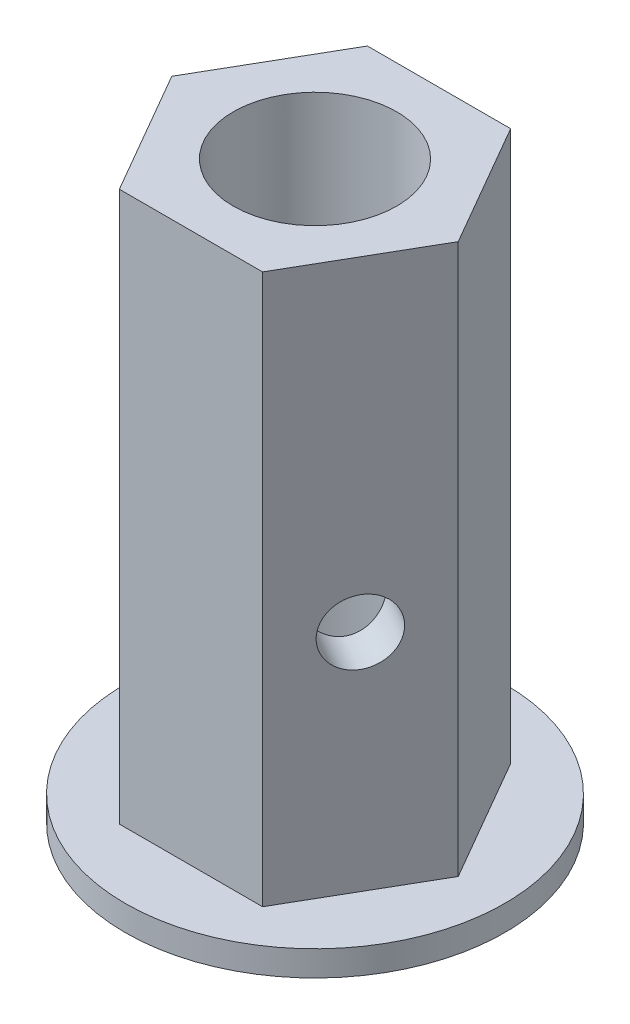
ISO-10303-21;
HEADER;
FILE_DESCRIPTION(('STEP AP214'),'2;1');
FILE_NAME('part.step','',(''),(''),'','','');
FILE_SCHEMA(('AUTOMOTIVE_DESIGN { 1 0 10303 214 1 1 1 1 }'));
ENDSEC;
DATA;
#1=APPLICATION_CONTEXT('core data for automotive mechanical design processes');
#2=APPLICATION_PROTOCOL_DEFINITION('international standard','automotive_design',2000,#1);
#3=PRODUCT_CONTEXT('',#1,'mechanical');
#4=PRODUCT('Part','Part','',(#3));
#5=PRODUCT_RELATED_PRODUCT_CATEGORY('part','',(#4));
#6=PRODUCT_DEFINITION_FORMATION('','',#4);
#7=PRODUCT_DEFINITION_CONTEXT('part definition',#1,'design');
#8=PRODUCT_DEFINITION('design','',#6,#7);
#9=PRODUCT_DEFINITION_SHAPE('','',#8);
#10=(LENGTH_UNIT() NAMED_UNIT(*) SI_UNIT(.MILLI.,.METRE.));
#11=(NAMED_UNIT(*) PLANE_ANGLE_UNIT() SI_UNIT($,.RADIAN.));
#12=(NAMED_UNIT(*) SI_UNIT($,.STERADIAN.) SOLID_ANGLE_UNIT());
#13=UNCERTAINTY_MEASURE_WITH_UNIT(LENGTH_MEASURE(1.E-05),#10,'distance_accuracy_value','');
#14=(GEOMETRIC_REPRESENTATION_CONTEXT(3) GLOBAL_UNCERTAINTY_ASSIGNED_CONTEXT((#13)) GLOBAL_UNIT_ASSIGNED_CONTEXT((#10,
#11,#12)) REPRESENTATION_CONTEXT('',''));
#15=CARTESIAN_POINT('',(0.,0.,0.));
#16=DIRECTION('',(0.,0.,1.));
#17=DIRECTION('',(1.,0.,0.));
#18=AXIS2_PLACEMENT_3D('',#15,#16,#17);
#19=CARTESIAN_POINT('',(-8.08391413162584,11.2776,-4.66725));
#20=DIRECTION('',(0.866025403784439,0.,0.5));
#21=DIRECTION('',(0.5,0.,-0.866025403784439));
#22=AXIS2_PLACEMENT_3D('',#19,#20,#21);
#23=CYLINDRICAL_SURFACE('',#22,1.6256);
#24=CARTESIAN_POINT('',(-2.44886932528421,11.2776,-3.29093655935237));
#25=CARTESIAN_POINT('',(-2.44888147324609,11.3647573048652,-3.29093271541478));
#26=CARTESIAN_POINT('',(-2.45505195509965,11.4520420576293,-3.28636415152895));
#27=CARTESIAN_POINT('',(-2.47927375272547,11.6241122051898,-3.26812494900121));
#28=CARTESIAN_POINT('',(-2.4973557667036,11.7088905490451,-3.25443079096739));
#29=CARTESIAN_POINT('',(-2.54392980849633,11.8731688700039,-3.21815273112463));
#30=CARTESIAN_POINT('',(-2.57238305406662,11.9526872242342,-3.19560192389171));
#31=CARTESIAN_POINT('',(-2.63782564146271,12.1049127393341,-3.14179683265406));
#32=CARTESIAN_POINT('',(-2.67481300206483,12.1776214755799,-3.11054456837446));
#33=CARTESIAN_POINT('',(-2.75733722691533,12.3182868121163,-3.03767861832686));
#34=CARTESIAN_POINT('',(-2.803213336595,12.3858134007232,-2.99561865056898));
#35=CARTESIAN_POINT('',(-2.89975632976159,12.5102660322667,-2.90226525996849));
#36=CARTESIAN_POINT('',(-2.95042486228355,12.5671884062225,-2.85096865334377));
#37=CARTESIAN_POINT('',(-3.05617045614329,12.6709380062377,-2.737386936309));
#38=CARTESIAN_POINT('',(-3.11134218568017,12.7172909491985,-2.67475419738384));
#39=CARTESIAN_POINT('',(-3.22158988359742,12.7953909960857,-2.54088277809653));
#40=CARTESIAN_POINT('',(-3.27666588147116,12.8271439395578,-2.4696475528811));
#41=CARTESIAN_POINT('',(-3.38159037782985,12.8736133561574,-2.32373752325829));
#42=CARTESIAN_POINT('',(-3.43156291603913,12.8890690351168,-2.24938800113922));
#43=CARTESIAN_POINT('',(-3.5271066331944,12.9048836773106,-2.09639337310828));
#44=CARTESIAN_POINT('',(-3.57267941613632,12.9052481631556,-2.01774984913289));
#45=CARTESIAN_POINT('',(-3.65559443332161,12.8912791964736,-1.8630977608545));
#46=CARTESIAN_POINT('',(-3.69325196844795,12.8777552118649,-1.78718306847896));
#47=CARTESIAN_POINT('',(-3.76263531184747,12.8377677257538,-1.63606721520194));
#48=CARTESIAN_POINT('',(-3.79436068530561,12.811303276256,-1.56086610698786));
#49=CARTESIAN_POINT('',(-3.85214936826359,12.7458595340862,-1.4123111892452));
#50=CARTESIAN_POINT('',(-3.87812053084457,12.706698335491,-1.33900205769166));
#51=CARTESIAN_POINT('',(-3.92410683161276,12.6171416512963,-1.19755975518268));
#52=CARTESIAN_POINT('',(-3.94411993941416,12.5667423461848,-1.1294283545713));
#53=CARTESIAN_POINT('',(-3.97994560252874,12.4523447447533,-0.996154348355632));
#54=CARTESIAN_POINT('',(-3.99540339573172,12.3876783944133,-0.931488948450088));
#55=CARTESIAN_POINT('',(-4.02128276858034,12.2484957204585,-0.812541036929739));
#56=CARTESIAN_POINT('',(-4.03170276234967,12.1739763045325,-0.758261798075933));
#57=CARTESIAN_POINT('',(-4.04880004572146,12.0146096699937,-0.661024716287477));
#58=CARTESIAN_POINT('',(-4.05536747179366,11.929536154508,-0.618416142119181));
#59=CARTESIAN_POINT('',(-4.06536912867255,11.7530461818509,-0.548860482295999));
#60=CARTESIAN_POINT('',(-4.06880535052941,11.6616337952553,-0.521903448202387));
#61=CARTESIAN_POINT('',(-4.07318756676947,11.4809455704553,-0.486486296882775));
#62=CARTESIAN_POINT('',(-4.07427107701614,11.3918726384786,-0.477009938699841));
#63=CARTESIAN_POINT('',(-4.07461876148592,11.2134698548878,-0.474037924438001));
#64=CARTESIAN_POINT('',(-4.07388347163581,11.1241400867004,-0.48053756087635));
#65=CARTESIAN_POINT('',(-4.07051016159081,10.9529658584926,-0.508275845096493));
#66=CARTESIAN_POINT('',(-4.06797993464985,10.8709810324101,-0.528677027222282));
#67=CARTESIAN_POINT('',(-4.06065976630209,10.7114035141565,-0.582229925679649));
#68=CARTESIAN_POINT('',(-4.05586932959691,10.633811788858,-0.615384436458852));
#69=CARTESIAN_POINT('',(-4.04308872398429,10.4817527372895,-0.69449266713499));
#70=CARTESIAN_POINT('',(-4.03497788410727,10.4075356827968,-0.740906555824861));
#71=CARTESIAN_POINT('',(-4.01467302317274,10.2672473147095,-0.844028114131318));
#72=CARTESIAN_POINT('',(-4.00247736223928,10.2011792871891,-0.900739913712852));
#73=CARTESIAN_POINT('',(-3.97203927195586,10.0741045550755,-1.02695339014244));
#74=CARTESIAN_POINT('',(-3.95342364558654,10.0138083424956,-1.09708307515602));
#75=CARTESIAN_POINT('',(-3.90950730998196,9.90571900426035,-1.24454337401823));
#76=CARTESIAN_POINT('',(-3.88420637115225,9.85792630812697,-1.32187423511858));
#77=CARTESIAN_POINT('',(-3.82633855894687,9.77640113946094,-1.48105183233594));
#78=CARTESIAN_POINT('',(-3.79377743868316,9.74265759447489,-1.56289495440586));
#79=CARTESIAN_POINT('',(-3.7213691836431,9.69052976723193,-1.72822474967795));
#80=CARTESIAN_POINT('',(-3.68152593528032,9.67213732122421,-1.81171052510191));
#81=CARTESIAN_POINT('',(-3.59808337904013,9.65219022594811,-1.97196768320743));
#82=CARTESIAN_POINT('',(-3.5548894747199,9.64963032372997,-2.04882601127039));
#83=CARTESIAN_POINT('',(-3.46403130868576,9.65877681768701,-2.19895560711226));
#84=CARTESIAN_POINT('',(-3.41636770309134,9.67048112299726,-2.27222739897261));
#85=CARTESIAN_POINT('',(-3.3197574159196,9.70710678130947,-2.41109640916123));
#86=CARTESIAN_POINT('',(-3.27089095953944,9.7316250127182,-2.47685698992836));
#87=CARTESIAN_POINT('',(-3.1723840673455,9.7927625206242,-2.60183423625484));
#88=CARTESIAN_POINT('',(-3.12274348915566,9.82938404877108,-2.66104968144559));
#89=CARTESIAN_POINT('',(-3.02244040465712,9.91550356341173,-2.77453891989434));
#90=CARTESIAN_POINT('',(-2.97182877657834,9.9654964605025,-2.82848143203808));
#91=CARTESIAN_POINT('',(-2.8740189938306,10.07619374555,-2.9278161186575));
#92=CARTESIAN_POINT('',(-2.82682222531534,10.1369024492362,-2.97320483285392));
#93=CARTESIAN_POINT('',(-2.73536034104265,10.2716514019271,-3.05763560970597));
#94=CARTESIAN_POINT('',(-2.69144546542943,10.3462760856868,-3.0961273971702));
#95=CARTESIAN_POINT('',(-2.61257562826085,10.5043486023814,-3.16296661751035));
#96=CARTESIAN_POINT('',(-2.57762178885791,10.5877975384935,-3.19131278006875));
#97=CARTESIAN_POINT('',(-2.52179303110655,10.7536198482867,-3.23557422778027));
#98=CARTESIAN_POINT('',(-2.49994398460341,10.8354314920089,-3.25236942661404));
#99=CARTESIAN_POINT('',(-2.4673789019941,11.0023861447986,-3.27714823440361));
#100=CARTESIAN_POINT('',(-2.45663165848253,11.0875191136162,-3.28515654745059));
#101=CARTESIAN_POINT('',(-2.44984618594192,11.207850297591,-3.29020835341419));
#102=CARTESIAN_POINT('',(-2.44886446301387,11.2427149400107,-3.29093809790378));
#103=CARTESIAN_POINT('',(-2.44886932528421,11.2776,-3.29093655935237));
#104=B_SPLINE_CURVE_WITH_KNOTS('',3,(#24,#25,#26,#27,#28,#29,#30,#31,#32,#33,#34,#35,#36,#37,
#38,#39,#40,#41,#42,#43,#44,#45,#46,#47,#48,#49,#50,#51,#52,#53,#54,#55,#56,#57,#58,#59,#60,#61,
#62,#63,#64,#65,#66,#67,#68,#69,#70,#71,#72,#73,#74,#75,#76,#77,#78,#79,#80,#81,#82,#83,#84,#85,
#86,#87,#88,#89,#90,#91,#92,#93,#94,#95,#96,#97,#98,#99,#100,#101,#102,#103),.UNSPECIFIED.,.T.,
.F.,(4,2,2,2,2,2,2,2,2,2,2,2,2,2,2,2,2,2,2,2,2,2,2,2,2,2,2,2,2,2,2,2,2,2,2,2,2,2,2,4),(0.,
0.261365013998918,0.523406262777047,0.784477520279435,1.04548823007986,1.31977908942136,
1.59416467584825,1.87913772671217,2.16399669785731,2.43529202379324,2.70648806853342,
2.96272792506798,3.21898655609182,3.47909207892356,3.739286139315,4.01628446144667,
4.29336992470477,4.57801479471436,4.86247853999813,5.12980973496651,5.39706216763264,
5.64949194319093,5.90197706147529,6.1645926422707,6.42731377828807,6.70901529698276,
6.9907264914424,7.27221524073855,7.55355419809704,7.81682976710346,8.08006674949742,
8.33548084387315,8.59094248125203,8.85762447622715,9.12441412193311,9.40734834344265,
9.69031797831293,9.94817621365627,10.205307615064,10.3099200076403),.UNSPECIFIED.);
#105=CARTESIAN_POINT('',(-2.44886932528421,11.2776,-3.29093655935237));
#106=VERTEX_POINT('',#105);
#107=EDGE_CURVE('E154',#106,#106,#104,.T.);
#108=ORIENTED_EDGE('',*,*,#107,.T.);
#109=EDGE_LOOP('',(#108));
#110=FACE_BOUND('',#109,.T.);
#111=CARTESIAN_POINT('',(-5.38927608775056,11.2776,-3.1115));
#112=DIRECTION('',(0.866025403784439,0.,0.5));
#113=DIRECTION('',(0.5,0.,-0.866025403784439));
#114=AXIS2_PLACEMENT_3D('',#111,#112,#113);
#115=CIRCLE('',#114,1.6256);
#116=CARTESIAN_POINT('',(-4.57647608775056,11.2776,-4.51931089639199));
#117=VERTEX_POINT('',#116);
#118=EDGE_CURVE('E130',#117,#117,#115,.T.);
#119=ORIENTED_EDGE('',*,*,#118,.F.);
#120=EDGE_LOOP('',(#119));
#121=FACE_BOUND('',#120,.T.);
#122=ADVANCED_FACE('F34',(#110,#121),#23,.F.);
#123=CARTESIAN_POINT('',(3.59285072516704,27.5844,-6.223));
#124=DIRECTION('',(0.,0.,1.));
#125=DIRECTION('',(1.,0.,0.));
#126=AXIS2_PLACEMENT_3D('',#123,#124,#125);
#127=PLANE('',#126);
#128=DIRECTION('',(-1.,0.,0.));
#129=VECTOR('',#128,1.);
#130=CARTESIAN_POINT('',(3.59285072516704,0.,-6.223));
#131=LINE('',#130,#129);
#132=CARTESIAN_POINT('',(3.59285072516704,0.,-6.223));
#133=VERTEX_POINT('',#132);
#134=CARTESIAN_POINT('',(-3.59285072516704,0.,-6.223));
#135=VERTEX_POINT('',#134);
#136=EDGE_CURVE('E89',#133,#135,#131,.T.);
#137=ORIENTED_EDGE('',*,*,#136,.T.);
#138=DIRECTION('',(0.,-1.,0.));
#139=VECTOR('',#138,1.);
#140=CARTESIAN_POINT('',(-3.59285072516704,27.5844,-6.223));
#141=LINE('',#140,#139);
#142=CARTESIAN_POINT('',(-3.59285072516704,27.5844,-6.223));
#143=VERTEX_POINT('',#142);
#144=EDGE_CURVE('E11',#143,#135,#141,.T.);
#145=ORIENTED_EDGE('',*,*,#144,.F.);
#146=DIRECTION('',(-1.,0.,0.));
#147=VECTOR('',#146,1.);
#148=CARTESIAN_POINT('',(3.59285072516704,27.5844,-6.223));
#149=LINE('',#148,#147);
#150=CARTESIAN_POINT('',(3.59285072516704,27.5844,-6.223));
#151=VERTEX_POINT('',#150);
#152=EDGE_CURVE('E93',#151,#143,#149,.T.);
#153=ORIENTED_EDGE('',*,*,#152,.F.);
#154=DIRECTION('',(0.,-1.,0.));
#155=VECTOR('',#154,1.);
#156=CARTESIAN_POINT('',(3.59285072516704,27.5844,-6.223));
#157=LINE('',#156,#155);
#158=EDGE_CURVE('E106',#151,#133,#157,.T.);
#159=ORIENTED_EDGE('',*,*,#158,.T.);
#160=EDGE_LOOP('',(#137,#145,#153,#159));
#161=FACE_BOUND('',#160,.T.);
#162=ADVANCED_FACE('F36',(#161),#127,.F.);
#163=CARTESIAN_POINT('',(-3.59285072516704,27.5844,-6.223));
#164=DIRECTION('',(0.866025403784439,0.,0.5));
#165=DIRECTION('',(0.5,0.,-0.866025403784439));
#166=AXIS2_PLACEMENT_3D('',#163,#164,#165);
#167=PLANE('',#166);
#168=ORIENTED_EDGE('',*,*,#118,.T.);
#169=EDGE_LOOP('',(#168));
#170=FACE_BOUND('',#169,.T.);
#171=DIRECTION('',(-0.5,0.,0.866025403784439));
#172=VECTOR('',#171,1.);
#173=CARTESIAN_POINT('',(-3.59285072516704,0.,-6.223));
#174=LINE('',#173,#172);
#175=CARTESIAN_POINT('',(-7.18570145033408,0.,0.));
#176=VERTEX_POINT('',#175);
#177=EDGE_CURVE('E126',#135,#176,#174,.T.);
#178=ORIENTED_EDGE('',*,*,#177,.T.);
#179=DIRECTION('',(0.,-1.,0.));
#180=VECTOR('',#179,1.);
#181=CARTESIAN_POINT('',(-7.18570145033408,27.5844,0.));
#182=LINE('',#181,#180);
#183=CARTESIAN_POINT('',(-7.18570145033408,27.5844,0.));
#184=VERTEX_POINT('',#183);
#185=EDGE_CURVE('E43',#184,#176,#182,.T.);
#186=ORIENTED_EDGE('',*,*,#185,.F.);
#187=DIRECTION('',(-0.5,0.,0.866025403784439));
#188=VECTOR('',#187,1.);
#189=CARTESIAN_POINT('',(-3.59285072516704,27.5844,-6.223));
#190=LINE('',#189,#188);
#191=EDGE_CURVE('E125',#143,#184,#190,.T.);
#192=ORIENTED_EDGE('',*,*,#191,.F.);
#193=ORIENTED_EDGE('',*,*,#144,.T.);
#194=EDGE_LOOP('',(#178,#186,#192,#193));
#195=FACE_BOUND('',#194,.T.);
#196=ADVANCED_FACE('F124',(#170,#195),#167,.F.);
#197=CARTESIAN_POINT('',(-7.18570145033408,27.5844,0.));
#198=DIRECTION('',(0.866025403784439,0.,-0.5));
#199=DIRECTION('',(-0.5,0.,-0.866025403784439));
#200=AXIS2_PLACEMENT_3D('',#197,#198,#199);
#201=PLANE('',#200);
#202=DIRECTION('',(0.5,0.,0.866025403784439));
#203=VECTOR('',#202,1.);
#204=CARTESIAN_POINT('',(-7.18570145033408,0.,0.));
#205=LINE('',#204,#203);
#206=CARTESIAN_POINT('',(-3.59285072516704,0.,6.223));
#207=VERTEX_POINT('',#206);
#208=EDGE_CURVE('E120',#176,#207,#205,.T.);
#209=ORIENTED_EDGE('',*,*,#208,.T.);
#210=DIRECTION('',(0.,-1.,0.));
#211=VECTOR('',#210,1.);
#212=CARTESIAN_POINT('',(-3.59285072516704,27.5844,6.223));
#213=LINE('',#212,#211);
#214=CARTESIAN_POINT('',(-3.59285072516704,27.5844,6.223));
#215=VERTEX_POINT('',#214);
#216=EDGE_CURVE('E108',#215,#207,#213,.T.);
#217=ORIENTED_EDGE('',*,*,#216,.F.);
#218=DIRECTION('',(0.5,0.,0.866025403784439));
#219=VECTOR('',#218,1.);
#220=CARTESIAN_POINT('',(-7.18570145033408,27.5844,0.));
#221=LINE('',#220,#219);
#222=EDGE_CURVE('E121',#184,#215,#221,.T.);
#223=ORIENTED_EDGE('',*,*,#222,.F.);
#224=ORIENTED_EDGE('',*,*,#185,.T.);
#225=EDGE_LOOP('',(#209,#217,#223,#224));
#226=FACE_BOUND('',#225,.T.);
#227=ADVANCED_FACE('F118',(#226),#201,.F.);
#228=CARTESIAN_POINT('',(-3.59285072516704,27.5844,6.223));
#229=DIRECTION('',(0.,0.,-1.));
#230=DIRECTION('',(-1.,0.,0.));
#231=AXIS2_PLACEMENT_3D('',#228,#229,#230);
#232=PLANE('',#231);
#233=DIRECTION('',(1.,0.,0.));
#234=VECTOR('',#233,1.);
#235=CARTESIAN_POINT('',(-3.59285072516704,0.,6.223));
#236=LINE('',#235,#234);
#237=CARTESIAN_POINT('',(3.59285072516704,0.,6.223));
#238=VERTEX_POINT('',#237);
#239=EDGE_CURVE('E103',#207,#238,#236,.T.);
#240=ORIENTED_EDGE('',*,*,#239,.T.);
#241=DIRECTION('',(0.,-1.,0.));
#242=VECTOR('',#241,1.);
#243=CARTESIAN_POINT('',(3.59285072516704,27.5844,6.223));
#244=LINE('',#243,#242);
#245=CARTESIAN_POINT('',(3.59285072516704,27.5844,6.223));
#246=VERTEX_POINT('',#245);
#247=EDGE_CURVE('E102',#246,#238,#244,.T.);
#248=ORIENTED_EDGE('',*,*,#247,.F.);
#249=DIRECTION('',(1.,0.,0.));
#250=VECTOR('',#249,1.);
#251=CARTESIAN_POINT('',(-3.59285072516704,27.5844,6.223));
#252=LINE('',#251,#250);
#253=EDGE_CURVE('E137',#215,#246,#252,.T.);
#254=ORIENTED_EDGE('',*,*,#253,.F.);
#255=ORIENTED_EDGE('',*,*,#216,.T.);
#256=EDGE_LOOP('',(#240,#248,#254,#255));
#257=FACE_BOUND('',#256,.T.);
#258=ADVANCED_FACE('F135',(#257),#232,.F.);
#259=CARTESIAN_POINT('',(3.59285072516704,27.5844,6.223));
#260=DIRECTION('',(-0.866025403784439,0.,-0.5));
#261=DIRECTION('',(-0.5,0.,0.866025403784439));
#262=AXIS2_PLACEMENT_3D('',#259,#260,#261);
#263=PLANE('',#262);
#264=CARTESIAN_POINT('',(5.38927608775056,11.2776,3.1115));
#265=DIRECTION('',(0.866025403784439,0.,0.5));
#266=DIRECTION('',(0.5,0.,-0.866025403784439));
#267=AXIS2_PLACEMENT_3D('',#264,#265,#266);
#268=CIRCLE('',#267,1.6256);
#269=CARTESIAN_POINT('',(6.20207608775056,11.2776,1.70368910360802));
#270=VERTEX_POINT('',#269);
#271=EDGE_CURVE('E147',#270,#270,#268,.T.);
#272=ORIENTED_EDGE('',*,*,#271,.F.);
#273=EDGE_LOOP('',(#272));
#274=FACE_BOUND('',#273,.T.);
#275=DIRECTION('',(0.5,0.,-0.866025403784439));
#276=VECTOR('',#275,1.);
#277=CARTESIAN_POINT('',(3.59285072516704,0.,6.223));
#278=LINE('',#277,#276);
#279=CARTESIAN_POINT('',(7.18570145033408,0.,0.));
#280=VERTEX_POINT('',#279);
#281=EDGE_CURVE('E86',#238,#280,#278,.T.);
#282=ORIENTED_EDGE('',*,*,#281,.T.);
#283=DIRECTION('',(0.,-1.,0.));
#284=VECTOR('',#283,1.);
#285=CARTESIAN_POINT('',(7.18570145033408,27.5844,0.));
#286=LINE('',#285,#284);
#287=CARTESIAN_POINT('',(7.18570145033408,27.5844,0.));
#288=VERTEX_POINT('',#287);
#289=EDGE_CURVE('E100',#288,#280,#286,.T.);
#290=ORIENTED_EDGE('',*,*,#289,.F.);
#291=DIRECTION('',(0.5,0.,-0.866025403784439));
#292=VECTOR('',#291,1.);
#293=CARTESIAN_POINT('',(3.59285072516704,27.5844,6.223));
#294=LINE('',#293,#292);
#295=EDGE_CURVE('E138',#246,#288,#294,.T.);
#296=ORIENTED_EDGE('',*,*,#295,.F.);
#297=ORIENTED_EDGE('',*,*,#247,.T.);
#298=EDGE_LOOP('',(#282,#290,#296,#297));
#299=FACE_BOUND('',#298,.T.);
#300=ADVANCED_FACE('F98',(#274,#299),#263,.F.);
#301=CARTESIAN_POINT('',(7.18570145033408,27.5844,0.));
#302=DIRECTION('',(-0.866025403784439,0.,0.5));
#303=DIRECTION('',(0.5,0.,0.866025403784439));
#304=AXIS2_PLACEMENT_3D('',#301,#302,#303);
#305=PLANE('',#304);
#306=DIRECTION('',(-0.5,0.,-0.866025403784439));
#307=VECTOR('',#306,1.);
#308=CARTESIAN_POINT('',(7.18570145033408,0.,0.));
#309=LINE('',#308,#307);
#310=EDGE_CURVE('E83',#280,#133,#309,.T.);
#311=ORIENTED_EDGE('',*,*,#310,.T.);
#312=ORIENTED_EDGE('',*,*,#158,.F.);
#313=DIRECTION('',(-0.5,0.,-0.866025403784439));
#314=VECTOR('',#313,1.);
#315=CARTESIAN_POINT('',(7.18570145033408,27.5844,0.));
#316=LINE('',#315,#314);
#317=EDGE_CURVE('E50',#288,#151,#316,.T.);
#318=ORIENTED_EDGE('',*,*,#317,.F.);
#319=ORIENTED_EDGE('',*,*,#289,.T.);
#320=EDGE_LOOP('',(#311,#312,#318,#319));
#321=FACE_BOUND('',#320,.T.);
#322=ADVANCED_FACE('F105',(#321),#305,.F.);
#323=CARTESIAN_POINT('',(0.,27.5844,0.));
#324=DIRECTION('',(0.,1.,0.));
#325=DIRECTION('',(0.,0.,1.));
#326=AXIS2_PLACEMENT_3D('',#323,#324,#325);
#327=PLANE('',#326);
#328=CARTESIAN_POINT('',(0.,27.5844,0.));
#329=DIRECTION('',(0.,1.,0.));
#330=DIRECTION('',(0.,0.,1.));
#331=AXIS2_PLACEMENT_3D('',#328,#329,#330);
#332=CIRCLE('',#331,4.1021);
#333=CARTESIAN_POINT('',(0.,27.5844,4.1021));
#334=VERTEX_POINT('',#333);
#335=EDGE_CURVE('E294',#334,#334,#332,.T.);
#336=ORIENTED_EDGE('',*,*,#335,.F.);
#337=EDGE_LOOP('',(#336));
#338=FACE_BOUND('',#337,.T.);
#339=ORIENTED_EDGE('',*,*,#152,.T.);
#340=ORIENTED_EDGE('',*,*,#191,.T.);
#341=ORIENTED_EDGE('',*,*,#222,.T.);
#342=ORIENTED_EDGE('',*,*,#253,.T.);
#343=ORIENTED_EDGE('',*,*,#295,.T.);
#344=ORIENTED_EDGE('',*,*,#317,.T.);
#345=EDGE_LOOP('',(#339,#340,#341,#342,#343,#344));
#346=FACE_BOUND('',#345,.T.);
#347=ADVANCED_FACE('F198',(#338,#346),#327,.T.);
#348=CARTESIAN_POINT('',(4.07446932528422,11.2776,0.475314766568403));
#349=CARTESIAN_POINT('',(4.07447207031754,11.1904426951348,0.475327208980787));
#350=CARTESIAN_POINT('',(4.07360081886039,11.1031579423707,0.482955284962476));
#351=CARTESIAN_POINT('',(4.06991610493951,10.9310877948102,0.513051578295633));
#352=CARTESIAN_POINT('',(4.06709762318785,10.8463094509549,0.53555814076919));
#353=CARTESIAN_POINT('',(4.05896692266036,10.6820311299961,0.594031474039989));
#354=CARTESIAN_POINT('',(4.05366397350596,10.6025127757658,0.629948111140433));
#355=CARTESIAN_POINT('',(4.03978869133926,10.4502872606659,0.713525599933659));
#356=CARTESIAN_POINT('',(4.0312171168484,10.3775785244201,0.76118372597383));
#357=CARTESIAN_POINT('',(4.00937546546154,10.2369131878837,0.86908477614579));
#358=CARTESIAN_POINT('',(3.9958885197407,10.1693865992768,0.929844636434121));
#359=CARTESIAN_POINT('',(3.96331360853455,10.0449339677333,1.06013001637402));
#360=CARTESIAN_POINT('',(3.94422371033059,9.98801159377752,1.12965855602288));
#361=CARTESIAN_POINT('',(3.8987318549029,9.88426199376228,1.27802778516106));
#362=CARTESIAN_POINT('',(3.87207617665355,9.83790905080145,1.35712427397331));
#363=CARTESIAN_POINT('',(3.81126397566868,9.75980900391427,1.51953729072206));
#364=CARTESIAN_POINT('',(3.77711045992468,9.72805606044219,1.60285211662721));
#365=CARTESIAN_POINT('',(3.70321091578373,9.68158664384258,1.76667441076453));
#366=CARTESIAN_POINT('',(3.66380860997403,9.66613096488319,1.84712665940488));
#367=CARTESIAN_POINT('',(3.57908323403431,9.65031632268942,2.00636725964881));
#368=CARTESIAN_POINT('',(3.53376233589946,9.6499518368444,2.08515620938536));
#369=CARTESIAN_POINT('',(3.4412872072947,9.66392080352639,2.23428876476224));
#370=CARTESIAN_POINT('',(3.39437192274018,9.67744478813508,2.30485849301333));
#371=CARTESIAN_POINT('',(3.29819342658747,9.71743227424616,2.44050415763533));
#372=CARTESIAN_POINT('',(3.24893004321041,9.74389672374399,2.50557969110166));
#373=CARTESIAN_POINT('',(3.14917205206716,9.80934046591383,2.62990361746585));
#374=CARTESIAN_POINT('',(3.0986700631029,9.84850166450897,2.68904986980356));
#375=CARTESIAN_POINT('',(2.99917058634446,9.93805834870371,2.79959632574938));
#376=CARTESIAN_POINT('',(2.95017361652029,9.98845765381521,2.85099388581975));
#377=CARTESIAN_POINT('',(2.85266777303068,10.1028552552467,2.94865682329224));
#378=CARTESIAN_POINT('',(2.80439479056809,10.1675216055867,2.99437636484523));
#379=CARTESIAN_POINT('',(2.71432256388867,10.3067042795415,3.07626251492632));
#380=CARTESIAN_POINT('',(2.67252536102786,10.3812236954675,3.11242611366475));
#381=CARTESIAN_POINT('',(2.59686421969509,10.5405903300063,3.17585133629464));
#382=CARTESIAN_POINT('',(2.56324782508241,10.625663845492,3.20284318119479));
#383=CARTESIAN_POINT('',(2.50801168513799,10.8021538181491,3.24628270004344));
#384=CARTESIAN_POINT('',(2.48638431973067,10.8935662047447,3.26273707251132));
#385=CARTESIAN_POINT('',(2.45790327507824,11.0742544295447,3.2842407587599));
#386=CARTESIAN_POINT('',(2.45023826327979,11.1633273615214,3.28991728525025));
#387=CARTESIAN_POINT('',(2.44783826566352,11.3417301451122,3.29170439596449));
#388=CARTESIAN_POINT('',(2.45309947100944,11.4310599132996,3.28781779805598));
#389=CARTESIAN_POINT('',(2.47543487477897,11.6022341415074,3.2710272837521));
#390=CARTESIAN_POINT('',(2.49183770329666,11.6842189675899,3.25863545188099));
#391=CARTESIAN_POINT('',(2.53455578963315,11.8437964858435,3.22551955090317));
#392=CARTESIAN_POINT('',(2.56087321986539,11.921388211142,3.20479365563166));
#393=CARTESIAN_POINT('',(2.62299265447305,12.0734472627106,3.15417121115731));
#394=CARTESIAN_POINT('',(2.65913284122839,12.1476643172032,3.12394007343284));
#395=CARTESIAN_POINT('',(2.73828629993236,12.2879526852905,3.05479476889001));
#396=CARTESIAN_POINT('',(2.78130232859757,12.3540207128109,3.01587711691492));
#397=CARTESIAN_POINT('',(2.87538736034383,12.4810954449245,2.92641021927201));
#398=CARTESIAN_POINT('',(2.92681363594034,12.5413916575044,2.87522377142202));
#399=CARTESIAN_POINT('',(3.03255983300236,12.6494809957397,2.76346095971623));
#400=CARTESIAN_POINT('',(3.08687985379694,12.697273691873,2.70288427339993));
#401=CARTESIAN_POINT('',(3.19579779059785,12.7787988605391,2.57318047935996));
#402=CARTESIAN_POINT('',(3.25039545330357,12.8125424055251,2.50406016100095));
#403=CARTESIAN_POINT('',(3.35737112849166,12.8646702327681,2.35868787505651));
#404=CARTESIAN_POINT('',(3.40975030668206,12.8830626787758,2.28243972209307));
#405=CARTESIAN_POINT('',(3.50681579861965,12.9030097740519,2.1300477695796));
#406=CARTESIAN_POINT('',(3.55178011105445,12.90556967627,2.05421158711815));
#407=CARTESIAN_POINT('',(3.63636707189633,12.896423182313,1.9004613092704));
#408=CARTESIAN_POINT('',(3.67599050223099,12.8847188770027,1.82254752005949));
#409=CARTESIAN_POINT('',(3.74794944926687,12.8480932186905,1.66944605200754));
#410=CARTESIAN_POINT('',(3.78046655458874,12.8235749872818,1.59424616900584));
#411=CARTESIAN_POINT('',(3.83944657870553,12.7624374793758,1.44644807475479));
#412=CARTESIAN_POINT('',(3.8659083694422,12.7258159512289,1.37385035038846));
#413=CARTESIAN_POINT('',(3.91404139074569,12.6396964365883,1.23024071191041));
#414=CARTESIAN_POINT('',(3.93545116256674,12.5897035394975,1.15943850019543));
#415=CARTESIAN_POINT('',(3.97257263328224,12.47900625445,1.02506540028754));
#416=CARTESIAN_POINT('',(3.98828202856383,12.4182975507638,0.961497442678581));
#417=CARTESIAN_POINT('',(4.01567028404262,12.2835485980729,0.840073738994412));
#418=CARTESIAN_POINT('',(4.0270477120171,12.2089239143132,0.78279644737722));
#419=CARTESIAN_POINT('',(4.04549725621653,12.0508513976186,0.681073554626812));
#420=CARTESIAN_POINT('',(4.05256883339043,11.9674024615065,0.636629560464867));
#421=CARTESIAN_POINT('',(4.06298599264121,11.8015801517133,0.566149714134701));
#422=CARTESIAN_POINT('',(4.06660653824129,11.7197685079911,0.538830285397634));
#423=CARTESIAN_POINT('',(4.0717830739579,11.5528138552014,0.498238692686842));
#424=CARTESIAN_POINT('',(4.07334485474225,11.4676808863838,0.484927150261674));
#425=CARTESIAN_POINT('',(4.07432711077142,11.347349702409,0.476524855683025));
#426=CARTESIAN_POINT('',(4.07446822657365,11.3124850599893,0.475309786443064));
#427=CARTESIAN_POINT('',(4.07446932528422,11.2776,0.475314766568403));
#428=B_SPLINE_CURVE_WITH_KNOTS('',3,(#348,#349,#350,#351,#352,#353,#354,#355,#356,#357,#358,
#359,#360,#361,#362,#363,#364,#365,#366,#367,#368,#369,#370,#371,#372,#373,#374,#375,#376,#377,
#378,#379,#380,#381,#382,#383,#384,#385,#386,#387,#388,#389,#390,#391,#392,#393,#394,#395,#396,
#397,#398,#399,#400,#401,#402,#403,#404,#405,#406,#407,#408,#409,#410,#411,#412,#413,#414,#415,
#416,#417,#418,#419,#420,#421,#422,#423,#424,#425,#426,#427),.UNSPECIFIED.,.T.,.F.,(4,2,2,2,2,2,
2,2,2,2,2,2,2,2,2,2,2,2,2,2,2,2,2,2,2,2,2,2,2,2,2,2,2,2,2,2,2,2,2,4),(0.,0.261365013998918,
0.523406262777047,0.784477520279436,1.04548823007987,1.31977908942137,1.59416467584825,
1.87913772671217,2.16399669785731,2.43529202379324,2.70648806853342,2.96272792506798,
3.21898655609182,3.47909207892356,3.739286139315,4.01628446144667,4.29336992470477,
4.57801479471436,4.86247853999813,5.12980973496651,5.39706216763264,5.64949194319093,
5.90197706147529,6.1645926422707,6.42731377828807,6.70901529698276,6.9907264914424,
7.27221524073855,7.55355419809704,7.81682976710346,8.08006674949742,8.33548084387315,
8.59094248125203,8.85762447622715,9.12441412193312,9.40734834344265,9.69031797831293,
9.94817621365628,10.205307615064,10.3099200076403),.UNSPECIFIED.);
#429=CARTESIAN_POINT('',(4.07446932528422,11.2776,0.475314766568403));
#430=VERTEX_POINT('',#429);
#431=EDGE_CURVE('E163',#430,#430,#428,.T.);
#432=ORIENTED_EDGE('',*,*,#431,.T.);
#433=EDGE_LOOP('',(#432));
#434=FACE_BOUND('',#433,.T.);
#435=ORIENTED_EDGE('',*,*,#271,.T.);
#436=EDGE_LOOP('',(#435));
#437=FACE_BOUND('',#436,.T.);
#438=ADVANCED_FACE('F167',(#434,#437),#23,.F.);
#439=CARTESIAN_POINT('',(0.,0.,0.));
#440=DIRECTION('',(0.,-1.,0.));
#441=DIRECTION('',(0.,0.,-1.));
#442=AXIS2_PLACEMENT_3D('',#439,#440,#441);
#443=PLANE('',#442);
#444=CARTESIAN_POINT('',(0.,0.,0.));
#445=DIRECTION('',(0.,-1.,0.));
#446=DIRECTION('',(0.,0.,-1.));
#447=AXIS2_PLACEMENT_3D('',#444,#445,#446);
#448=CIRCLE('',#447,9.525);
#449=CARTESIAN_POINT('',(0.,0.,-9.525));
#450=VERTEX_POINT('',#449);
#451=EDGE_CURVE('E151',#450,#450,#448,.T.);
#452=ORIENTED_EDGE('',*,*,#451,.F.);
#453=EDGE_LOOP('',(#452));
#454=FACE_BOUND('',#453,.T.);
#455=ORIENTED_EDGE('',*,*,#177,.F.);
#456=ORIENTED_EDGE('',*,*,#136,.F.);
#457=ORIENTED_EDGE('',*,*,#310,.F.);
#458=ORIENTED_EDGE('',*,*,#281,.F.);
#459=ORIENTED_EDGE('',*,*,#239,.F.);
#460=ORIENTED_EDGE('',*,*,#208,.F.);
#461=EDGE_LOOP('',(#455,#456,#457,#458,#459,#460));
#462=FACE_BOUND('',#461,.T.);
#463=ADVANCED_FACE('F85',(#454,#462),#443,.F.);
#464=CARTESIAN_POINT('',(0.,-1.27,0.));
#465=DIRECTION('',(0.,1.,0.));
#466=DIRECTION('',(0.,0.,1.));
#467=AXIS2_PLACEMENT_3D('',#464,#465,#466);
#468=CYLINDRICAL_SURFACE('',#467,9.525);
#469=CARTESIAN_POINT('',(0.,-1.27,0.));
#470=DIRECTION('',(0.,-1.,0.));
#471=DIRECTION('',(0.,0.,-1.));
#472=AXIS2_PLACEMENT_3D('',#469,#470,#471);
#473=CIRCLE('',#472,9.525);
#474=CARTESIAN_POINT('',(0.,-1.27,-9.525));
#475=VERTEX_POINT('',#474);
#476=EDGE_CURVE('E150',#475,#475,#473,.T.);
#477=ORIENTED_EDGE('',*,*,#476,.F.);
#478=EDGE_LOOP('',(#477));
#479=FACE_BOUND('',#478,.T.);
#480=ORIENTED_EDGE('',*,*,#451,.T.);
#481=EDGE_LOOP('',(#480));
#482=FACE_BOUND('',#481,.T.);
#483=ADVANCED_FACE('F180',(#479,#482),#468,.T.);
#484=CARTESIAN_POINT('',(0.,-1.27,0.));
#485=DIRECTION('',(0.,-1.,0.));
#486=DIRECTION('',(0.,0.,-1.));
#487=AXIS2_PLACEMENT_3D('',#484,#485,#486);
#488=PLANE('',#487);
#489=CARTESIAN_POINT('',(0.,-1.27,0.));
#490=DIRECTION('',(0.,1.,0.));
#491=DIRECTION('',(0.,0.,1.));
#492=AXIS2_PLACEMENT_3D('',#489,#490,#491);
#493=CIRCLE('',#492,4.1021);
#494=CARTESIAN_POINT('',(0.,-1.27,4.1021));
#495=VERTEX_POINT('',#494);
#496=EDGE_CURVE('E292',#495,#495,#493,.T.);
#497=ORIENTED_EDGE('',*,*,#496,.T.);
#498=EDGE_LOOP('',(#497));
#499=FACE_BOUND('',#498,.T.);
#500=ORIENTED_EDGE('',*,*,#476,.T.);
#501=EDGE_LOOP('',(#500));
#502=FACE_BOUND('',#501,.T.);
#503=ADVANCED_FACE('F175',(#499,#502),#488,.T.);
#504=CARTESIAN_POINT('',(0.,-1.27,0.));
#505=DIRECTION('',(0.,1.,0.));
#506=DIRECTION('',(0.,0.,1.));
#507=AXIS2_PLACEMENT_3D('',#504,#505,#506);
#508=CYLINDRICAL_SURFACE('',#507,4.1021);
#509=ORIENTED_EDGE('',*,*,#431,.F.);
#510=EDGE_LOOP('',(#509));
#511=FACE_BOUND('',#510,.T.);
#512=ORIENTED_EDGE('',*,*,#496,.F.);
#513=EDGE_LOOP('',(#512));
#514=FACE_BOUND('',#513,.T.);
#515=ORIENTED_EDGE('',*,*,#335,.T.);
#516=EDGE_LOOP('',(#515));
#517=FACE_BOUND('',#516,.T.);
#518=ORIENTED_EDGE('',*,*,#107,.F.);
#519=EDGE_LOOP('',(#518));
#520=FACE_BOUND('',#519,.T.);
#521=ADVANCED_FACE('F171',(#511,#514,#517,#520),#508,.F.);
#522=CLOSED_SHELL('',(#122,#162,#196,#227,#258,#300,#322,#347,#438,#463,#483,#503,#521));
#523=MANIFOLD_SOLID_BREP('B2',#522);
#524=ADVANCED_BREP_SHAPE_REPRESENTATION('',(#18,#523),#14);
#525=SHAPE_DEFINITION_REPRESENTATION(#9,#524);
ENDSEC;
END-ISO-10303-21;
